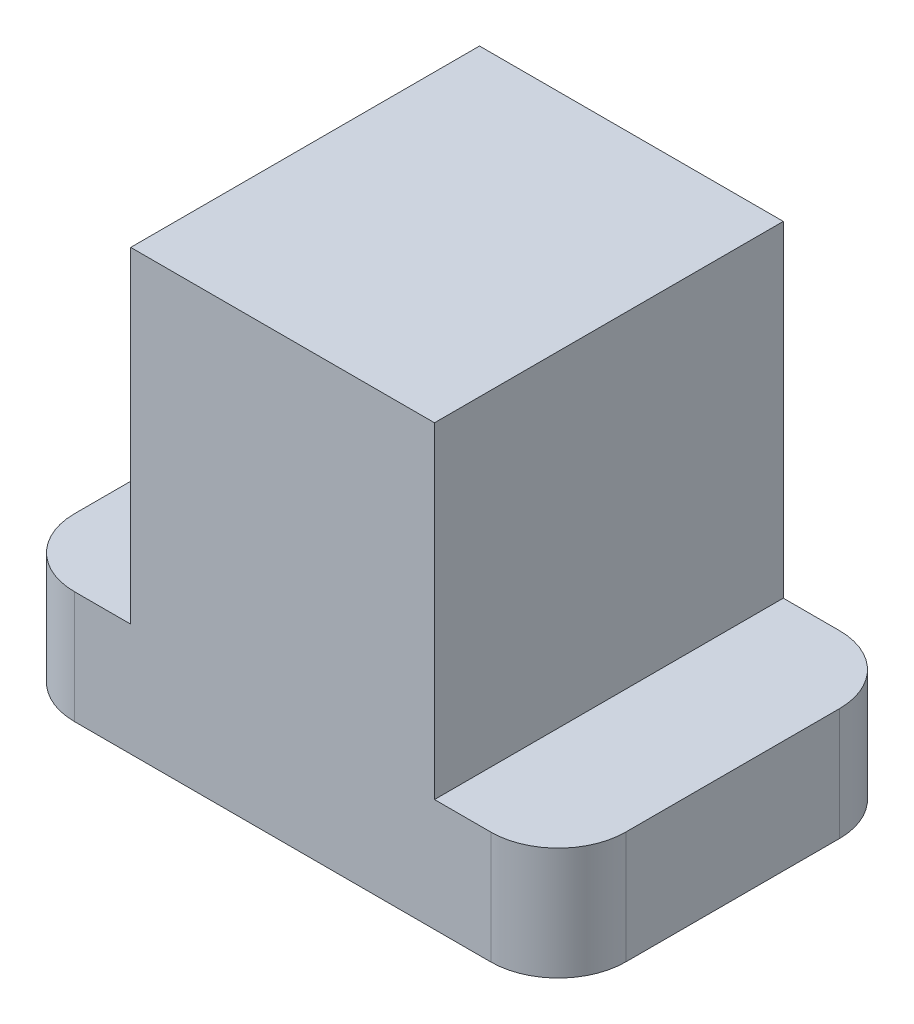
ISO-10303-21;
HEADER;
FILE_DESCRIPTION(('STEP AP214'),'2;1');
FILE_NAME('part.step','',(''),(''),'','','');
FILE_SCHEMA(('AUTOMOTIVE_DESIGN { 1 0 10303 214 1 1 1 1 }'));
ENDSEC;
DATA;
#1=APPLICATION_CONTEXT('core data for automotive mechanical design processes');
#2=APPLICATION_PROTOCOL_DEFINITION('international standard','automotive_design',2000,#1);
#3=PRODUCT_CONTEXT('',#1,'mechanical');
#4=PRODUCT('Part','Part','',(#3));
#5=PRODUCT_RELATED_PRODUCT_CATEGORY('part','',(#4));
#6=PRODUCT_DEFINITION_FORMATION('','',#4);
#7=PRODUCT_DEFINITION_CONTEXT('part definition',#1,'design');
#8=PRODUCT_DEFINITION('design','',#6,#7);
#9=PRODUCT_DEFINITION_SHAPE('','',#8);
#10=(LENGTH_UNIT() NAMED_UNIT(*) SI_UNIT(.MILLI.,.METRE.));
#11=(NAMED_UNIT(*) PLANE_ANGLE_UNIT() SI_UNIT($,.RADIAN.));
#12=(NAMED_UNIT(*) SI_UNIT($,.STERADIAN.) SOLID_ANGLE_UNIT());
#13=UNCERTAINTY_MEASURE_WITH_UNIT(LENGTH_MEASURE(1.E-05),#10,'distance_accuracy_value','');
#14=(GEOMETRIC_REPRESENTATION_CONTEXT(3) GLOBAL_UNCERTAINTY_ASSIGNED_CONTEXT((#13)) GLOBAL_UNIT_ASSIGNED_CONTEXT((#10,
#11,#12)) REPRESENTATION_CONTEXT('',''));
#15=CARTESIAN_POINT('',(0.,0.,0.));
#16=DIRECTION('',(0.,0.,1.));
#17=DIRECTION('',(1.,0.,0.));
#18=AXIS2_PLACEMENT_3D('',#15,#16,#17);
#19=CARTESIAN_POINT('',(37.,20.,-19.));
#20=DIRECTION('',(0.,-1.,0.));
#21=DIRECTION('',(0.,0.,-1.));
#22=AXIS2_PLACEMENT_3D('',#19,#20,#21);
#23=PLANE('',#22);
#24=DIRECTION('',(0.,0.,-1.));
#25=VECTOR('',#24,1.);
#26=CARTESIAN_POINT('',(27.,20.,31.));
#27=LINE('',#26,#25);
#28=CARTESIAN_POINT('',(27.,20.,31.));
#29=VERTEX_POINT('',#28);
#30=CARTESIAN_POINT('',(27.,20.,-31.));
#31=VERTEX_POINT('',#30);
#32=EDGE_CURVE('E59',#29,#31,#27,.T.);
#33=ORIENTED_EDGE('',*,*,#32,.F.);
#34=DIRECTION('',(1.,0.,0.));
#35=VECTOR('',#34,1.);
#36=CARTESIAN_POINT('',(-36.9999999999999,20.,31.));
#37=LINE('',#36,#35);
#38=CARTESIAN_POINT('',(36.9999999999999,20.,31.));
#39=VERTEX_POINT('',#38);
#40=EDGE_CURVE('E186',#29,#39,#37,.T.);
#41=ORIENTED_EDGE('',*,*,#40,.T.);
#42=CARTESIAN_POINT('',(37.,20.,19.));
#43=DIRECTION('',(0.,1.,0.));
#44=DIRECTION('',(0.,0.,1.));
#45=AXIS2_PLACEMENT_3D('',#42,#43,#44);
#46=CIRCLE('',#45,12.);
#47=CARTESIAN_POINT('',(49.,20.,18.9999999999999));
#48=VERTEX_POINT('',#47);
#49=EDGE_CURVE('E190',#39,#48,#46,.T.);
#50=ORIENTED_EDGE('',*,*,#49,.T.);
#51=DIRECTION('',(0.,0.,-1.));
#52=VECTOR('',#51,1.);
#53=CARTESIAN_POINT('',(49.,20.,18.9999999999999));
#54=LINE('',#53,#52);
#55=CARTESIAN_POINT('',(49.,20.,-18.9999999999999));
#56=VERTEX_POINT('',#55);
#57=EDGE_CURVE('E193',#48,#56,#54,.T.);
#58=ORIENTED_EDGE('',*,*,#57,.T.);
#59=CARTESIAN_POINT('',(37.,20.,-19.));
#60=DIRECTION('',(0.,1.,0.));
#61=DIRECTION('',(0.,0.,-1.));
#62=AXIS2_PLACEMENT_3D('',#59,#60,#61);
#63=CIRCLE('',#62,12.);
#64=CARTESIAN_POINT('',(36.9999999999999,20.,-31.));
#65=VERTEX_POINT('',#64);
#66=EDGE_CURVE('E168',#56,#65,#63,.T.);
#67=ORIENTED_EDGE('',*,*,#66,.T.);
#68=DIRECTION('',(-1.,0.,0.));
#69=VECTOR('',#68,1.);
#70=CARTESIAN_POINT('',(-36.9999999999999,20.,-31.));
#71=LINE('',#70,#69);
#72=EDGE_CURVE('E174',#65,#31,#71,.T.);
#73=ORIENTED_EDGE('',*,*,#72,.T.);
#74=EDGE_LOOP('',(#33,#41,#50,#58,#67,#73));
#75=FACE_BOUND('',#74,.T.);
#76=ADVANCED_FACE('F43',(#75),#23,.F.);
#77=DIRECTION('',(0.,0.,1.));
#78=VECTOR('',#77,1.);
#79=CARTESIAN_POINT('',(-27.,20.,31.));
#80=LINE('',#79,#78);
#81=CARTESIAN_POINT('',(-27.,20.,-31.));
#82=VERTEX_POINT('',#81);
#83=CARTESIAN_POINT('',(-27.,20.,31.));
#84=VERTEX_POINT('',#83);
#85=EDGE_CURVE('E67',#82,#84,#80,.T.);
#86=ORIENTED_EDGE('',*,*,#85,.F.);
#87=CARTESIAN_POINT('',(-36.9999999999999,20.,-31.));
#88=VERTEX_POINT('',#87);
#89=EDGE_CURVE('E172',#82,#88,#71,.T.);
#90=ORIENTED_EDGE('',*,*,#89,.T.);
#91=CARTESIAN_POINT('',(-37.,20.,-19.));
#92=DIRECTION('',(0.,1.,0.));
#93=DIRECTION('',(0.,0.,-1.));
#94=AXIS2_PLACEMENT_3D('',#91,#92,#93);
#95=CIRCLE('',#94,12.);
#96=CARTESIAN_POINT('',(-49.,20.,-18.9999999999999));
#97=VERTEX_POINT('',#96);
#98=EDGE_CURVE('E177',#88,#97,#95,.T.);
#99=ORIENTED_EDGE('',*,*,#98,.T.);
#100=DIRECTION('',(0.,0.,1.));
#101=VECTOR('',#100,1.);
#102=CARTESIAN_POINT('',(-49.,20.,18.9999999999999));
#103=LINE('',#102,#101);
#104=CARTESIAN_POINT('',(-49.,20.,18.9999999999999));
#105=VERTEX_POINT('',#104);
#106=EDGE_CURVE('E180',#97,#105,#103,.T.);
#107=ORIENTED_EDGE('',*,*,#106,.T.);
#108=CARTESIAN_POINT('',(-37.,20.,19.));
#109=DIRECTION('',(0.,1.,0.));
#110=DIRECTION('',(0.,0.,-1.));
#111=AXIS2_PLACEMENT_3D('',#108,#109,#110);
#112=CIRCLE('',#111,12.);
#113=CARTESIAN_POINT('',(-36.9999999999999,20.,31.));
#114=VERTEX_POINT('',#113);
#115=EDGE_CURVE('E183',#105,#114,#112,.T.);
#116=ORIENTED_EDGE('',*,*,#115,.T.);
#117=EDGE_CURVE('E187',#114,#84,#37,.T.);
#118=ORIENTED_EDGE('',*,*,#117,.T.);
#119=EDGE_LOOP('',(#86,#90,#99,#107,#116,#118));
#120=FACE_BOUND('',#119,.T.);
#121=ADVANCED_FACE('F261',(#120),#23,.F.);
#122=CARTESIAN_POINT('',(37.,20.,-19.));
#123=DIRECTION('',(0.,-1.,0.));
#124=DIRECTION('',(0.,0.,-1.));
#125=AXIS2_PLACEMENT_3D('',#122,#123,#124);
#126=CYLINDRICAL_SURFACE('',#125,12.);
#127=CARTESIAN_POINT('',(37.,0.,-19.));
#128=DIRECTION('',(0.,1.,0.));
#129=DIRECTION('',(0.,0.,-1.));
#130=AXIS2_PLACEMENT_3D('',#127,#128,#129);
#131=CIRCLE('',#130,12.);
#132=CARTESIAN_POINT('',(49.,0.,-18.9999999999999));
#133=VERTEX_POINT('',#132);
#134=CARTESIAN_POINT('',(36.9999999999999,0.,-31.));
#135=VERTEX_POINT('',#134);
#136=EDGE_CURVE('E157',#133,#135,#131,.T.);
#137=ORIENTED_EDGE('',*,*,#136,.T.);
#138=DIRECTION('',(0.,-1.,0.));
#139=VECTOR('',#138,1.);
#140=CARTESIAN_POINT('',(36.9999999999999,20.,-31.));
#141=LINE('',#140,#139);
#142=EDGE_CURVE('E11',#65,#135,#141,.T.);
#143=ORIENTED_EDGE('',*,*,#142,.F.);
#144=ORIENTED_EDGE('',*,*,#66,.F.);
#145=DIRECTION('',(0.,-1.,0.));
#146=VECTOR('',#145,1.);
#147=CARTESIAN_POINT('',(49.,20.,-18.9999999999999));
#148=LINE('',#147,#146);
#149=EDGE_CURVE('E195',#56,#133,#148,.T.);
#150=ORIENTED_EDGE('',*,*,#149,.T.);
#151=EDGE_LOOP('',(#137,#143,#144,#150));
#152=FACE_BOUND('',#151,.T.);
#153=ADVANCED_FACE('F45',(#152),#126,.T.);
#154=CARTESIAN_POINT('',(-36.9999999999999,20.,-31.));
#155=DIRECTION('',(0.,0.,1.));
#156=DIRECTION('',(1.,0.,0.));
#157=AXIS2_PLACEMENT_3D('',#154,#155,#156);
#158=PLANE('',#157);
#159=DIRECTION('',(-1.,0.,0.));
#160=VECTOR('',#159,1.);
#161=CARTESIAN_POINT('',(-36.9999999999999,0.,-31.));
#162=LINE('',#161,#160);
#163=CARTESIAN_POINT('',(-36.9999999999999,0.,-31.));
#164=VERTEX_POINT('',#163);
#165=EDGE_CURVE('E162',#135,#164,#162,.T.);
#166=ORIENTED_EDGE('',*,*,#165,.T.);
#167=DIRECTION('',(0.,-1.,0.));
#168=VECTOR('',#167,1.);
#169=CARTESIAN_POINT('',(-36.9999999999999,20.,-31.));
#170=LINE('',#169,#168);
#171=EDGE_CURVE('E52',#88,#164,#170,.T.);
#172=ORIENTED_EDGE('',*,*,#171,.F.);
#173=ORIENTED_EDGE('',*,*,#89,.F.);
#174=DIRECTION('',(0.,-1.,0.));
#175=VECTOR('',#174,1.);
#176=CARTESIAN_POINT('',(-27.,78.,-31.));
#177=LINE('',#176,#175);
#178=CARTESIAN_POINT('',(-27.,78.,-31.));
#179=VERTEX_POINT('',#178);
#180=EDGE_CURVE('E139',#179,#82,#177,.T.);
#181=ORIENTED_EDGE('',*,*,#180,.F.);
#182=DIRECTION('',(-1.,0.,0.));
#183=VECTOR('',#182,1.);
#184=CARTESIAN_POINT('',(-27.,78.,-31.));
#185=LINE('',#184,#183);
#186=CARTESIAN_POINT('',(27.,78.,-31.));
#187=VERTEX_POINT('',#186);
#188=EDGE_CURVE('E133',#187,#179,#185,.T.);
#189=ORIENTED_EDGE('',*,*,#188,.F.);
#190=DIRECTION('',(0.,-1.,0.));
#191=VECTOR('',#190,1.);
#192=CARTESIAN_POINT('',(27.,78.,-31.));
#193=LINE('',#192,#191);
#194=EDGE_CURVE('E137',#187,#31,#193,.T.);
#195=ORIENTED_EDGE('',*,*,#194,.T.);
#196=ORIENTED_EDGE('',*,*,#72,.F.);
#197=ORIENTED_EDGE('',*,*,#142,.T.);
#198=EDGE_LOOP('',(#166,#172,#173,#181,#189,#195,#196,#197));
#199=FACE_BOUND('',#198,.T.);
#200=ADVANCED_FACE('F135',(#199),#158,.F.);
#201=CARTESIAN_POINT('',(-37.,20.,-19.));
#202=DIRECTION('',(0.,-1.,0.));
#203=DIRECTION('',(0.,0.,-1.));
#204=AXIS2_PLACEMENT_3D('',#201,#202,#203);
#205=CYLINDRICAL_SURFACE('',#204,12.);
#206=CARTESIAN_POINT('',(-37.,0.,-19.));
#207=DIRECTION('',(0.,1.,0.));
#208=DIRECTION('',(0.,0.,-1.));
#209=AXIS2_PLACEMENT_3D('',#206,#207,#208);
#210=CIRCLE('',#209,12.);
#211=CARTESIAN_POINT('',(-49.,0.,-18.9999999999999));
#212=VERTEX_POINT('',#211);
#213=EDGE_CURVE('E199',#164,#212,#210,.T.);
#214=ORIENTED_EDGE('',*,*,#213,.T.);
#215=DIRECTION('',(0.,-1.,0.));
#216=VECTOR('',#215,1.);
#217=CARTESIAN_POINT('',(-49.,20.,-18.9999999999999));
#218=LINE('',#217,#216);
#219=EDGE_CURVE('E235',#97,#212,#218,.T.);
#220=ORIENTED_EDGE('',*,*,#219,.F.);
#221=ORIENTED_EDGE('',*,*,#98,.F.);
#222=ORIENTED_EDGE('',*,*,#171,.T.);
#223=EDGE_LOOP('',(#214,#220,#221,#222));
#224=FACE_BOUND('',#223,.T.);
#225=ADVANCED_FACE('F244',(#224),#205,.T.);
#226=CARTESIAN_POINT('',(-49.,20.,18.9999999999999));
#227=DIRECTION('',(1.,0.,0.));
#228=DIRECTION('',(0.,0.,-1.));
#229=AXIS2_PLACEMENT_3D('',#226,#227,#228);
#230=PLANE('',#229);
#231=DIRECTION('',(0.,0.,1.));
#232=VECTOR('',#231,1.);
#233=CARTESIAN_POINT('',(-49.,0.,18.9999999999999));
#234=LINE('',#233,#232);
#235=CARTESIAN_POINT('',(-49.,0.,18.9999999999999));
#236=VERTEX_POINT('',#235);
#237=EDGE_CURVE('E202',#212,#236,#234,.T.);
#238=ORIENTED_EDGE('',*,*,#237,.T.);
#239=DIRECTION('',(0.,-1.,0.));
#240=VECTOR('',#239,1.);
#241=CARTESIAN_POINT('',(-49.,20.,18.9999999999999));
#242=LINE('',#241,#240);
#243=EDGE_CURVE('E231',#105,#236,#242,.T.);
#244=ORIENTED_EDGE('',*,*,#243,.F.);
#245=ORIENTED_EDGE('',*,*,#106,.F.);
#246=ORIENTED_EDGE('',*,*,#219,.T.);
#247=EDGE_LOOP('',(#238,#244,#245,#246));
#248=FACE_BOUND('',#247,.T.);
#249=ADVANCED_FACE('F254',(#248),#230,.F.);
#250=CARTESIAN_POINT('',(-37.,20.,19.));
#251=DIRECTION('',(0.,-1.,0.));
#252=DIRECTION('',(0.,0.,-1.));
#253=AXIS2_PLACEMENT_3D('',#250,#251,#252);
#254=CYLINDRICAL_SURFACE('',#253,12.);
#255=CARTESIAN_POINT('',(-37.,0.,19.));
#256=DIRECTION('',(0.,1.,0.));
#257=DIRECTION('',(0.,0.,-1.));
#258=AXIS2_PLACEMENT_3D('',#255,#256,#257);
#259=CIRCLE('',#258,12.);
#260=CARTESIAN_POINT('',(-36.9999999999999,0.,31.));
#261=VERTEX_POINT('',#260);
#262=EDGE_CURVE('E205',#236,#261,#259,.T.);
#263=ORIENTED_EDGE('',*,*,#262,.T.);
#264=DIRECTION('',(0.,-1.,0.));
#265=VECTOR('',#264,1.);
#266=CARTESIAN_POINT('',(-36.9999999999999,20.,31.));
#267=LINE('',#266,#265);
#268=EDGE_CURVE('E227',#114,#261,#267,.T.);
#269=ORIENTED_EDGE('',*,*,#268,.F.);
#270=ORIENTED_EDGE('',*,*,#115,.F.);
#271=ORIENTED_EDGE('',*,*,#243,.T.);
#272=EDGE_LOOP('',(#263,#269,#270,#271));
#273=FACE_BOUND('',#272,.T.);
#274=ADVANCED_FACE('F258',(#273),#254,.T.);
#275=CARTESIAN_POINT('',(-36.9999999999999,20.,31.));
#276=DIRECTION('',(0.,0.,-1.));
#277=DIRECTION('',(-1.,0.,0.));
#278=AXIS2_PLACEMENT_3D('',#275,#276,#277);
#279=PLANE('',#278);
#280=DIRECTION('',(1.,0.,0.));
#281=VECTOR('',#280,1.);
#282=CARTESIAN_POINT('',(-36.9999999999999,0.,31.));
#283=LINE('',#282,#281);
#284=CARTESIAN_POINT('',(36.9999999999999,0.,31.));
#285=VERTEX_POINT('',#284);
#286=EDGE_CURVE('E208',#261,#285,#283,.T.);
#287=ORIENTED_EDGE('',*,*,#286,.T.);
#288=DIRECTION('',(0.,-1.,0.));
#289=VECTOR('',#288,1.);
#290=CARTESIAN_POINT('',(36.9999999999999,20.,31.));
#291=LINE('',#290,#289);
#292=EDGE_CURVE('E223',#39,#285,#291,.T.);
#293=ORIENTED_EDGE('',*,*,#292,.F.);
#294=ORIENTED_EDGE('',*,*,#40,.F.);
#295=DIRECTION('',(0.,-1.,0.));
#296=VECTOR('',#295,1.);
#297=CARTESIAN_POINT('',(27.,78.,31.));
#298=LINE('',#297,#296);
#299=CARTESIAN_POINT('',(27.,78.,31.));
#300=VERTEX_POINT('',#299);
#301=EDGE_CURVE('E430',#300,#29,#298,.T.);
#302=ORIENTED_EDGE('',*,*,#301,.F.);
#303=DIRECTION('',(1.,0.,0.));
#304=VECTOR('',#303,1.);
#305=CARTESIAN_POINT('',(-27.,78.,31.));
#306=LINE('',#305,#304);
#307=CARTESIAN_POINT('',(-27.,78.,31.));
#308=VERTEX_POINT('',#307);
#309=EDGE_CURVE('E149',#308,#300,#306,.T.);
#310=ORIENTED_EDGE('',*,*,#309,.F.);
#311=DIRECTION('',(0.,-1.,0.));
#312=VECTOR('',#311,1.);
#313=CARTESIAN_POINT('',(-27.,78.,31.));
#314=LINE('',#313,#312);
#315=EDGE_CURVE('E164',#308,#84,#314,.T.);
#316=ORIENTED_EDGE('',*,*,#315,.T.);
#317=ORIENTED_EDGE('',*,*,#117,.F.);
#318=ORIENTED_EDGE('',*,*,#268,.T.);
#319=EDGE_LOOP('',(#287,#293,#294,#302,#310,#316,#317,#318));
#320=FACE_BOUND('',#319,.T.);
#321=ADVANCED_FACE('F268',(#320),#279,.F.);
#322=CARTESIAN_POINT('',(37.,20.,19.));
#323=DIRECTION('',(0.,-1.,0.));
#324=DIRECTION('',(0.,0.,-1.));
#325=AXIS2_PLACEMENT_3D('',#322,#323,#324);
#326=CYLINDRICAL_SURFACE('',#325,12.);
#327=CARTESIAN_POINT('',(37.,0.,19.));
#328=DIRECTION('',(0.,1.,0.));
#329=DIRECTION('',(0.,0.,1.));
#330=AXIS2_PLACEMENT_3D('',#327,#328,#329);
#331=CIRCLE('',#330,12.);
#332=CARTESIAN_POINT('',(49.,0.,18.9999999999999));
#333=VERTEX_POINT('',#332);
#334=EDGE_CURVE('E211',#285,#333,#331,.T.);
#335=ORIENTED_EDGE('',*,*,#334,.T.);
#336=DIRECTION('',(0.,-1.,0.));
#337=VECTOR('',#336,1.);
#338=CARTESIAN_POINT('',(49.,20.,18.9999999999999));
#339=LINE('',#338,#337);
#340=EDGE_CURVE('E219',#48,#333,#339,.T.);
#341=ORIENTED_EDGE('',*,*,#340,.F.);
#342=ORIENTED_EDGE('',*,*,#49,.F.);
#343=ORIENTED_EDGE('',*,*,#292,.T.);
#344=EDGE_LOOP('',(#335,#341,#342,#343));
#345=FACE_BOUND('',#344,.T.);
#346=ADVANCED_FACE('F271',(#345),#326,.T.);
#347=CARTESIAN_POINT('',(49.,20.,18.9999999999999));
#348=DIRECTION('',(-1.,0.,0.));
#349=DIRECTION('',(0.,0.,1.));
#350=AXIS2_PLACEMENT_3D('',#347,#348,#349);
#351=PLANE('',#350);
#352=DIRECTION('',(0.,0.,-1.));
#353=VECTOR('',#352,1.);
#354=CARTESIAN_POINT('',(49.,0.,18.9999999999999));
#355=LINE('',#354,#353);
#356=EDGE_CURVE('E173',#333,#133,#355,.T.);
#357=ORIENTED_EDGE('',*,*,#356,.T.);
#358=ORIENTED_EDGE('',*,*,#149,.F.);
#359=ORIENTED_EDGE('',*,*,#57,.F.);
#360=ORIENTED_EDGE('',*,*,#340,.T.);
#361=EDGE_LOOP('',(#357,#358,#359,#360));
#362=FACE_BOUND('',#361,.T.);
#363=ADVANCED_FACE('F276',(#362),#351,.F.);
#364=CARTESIAN_POINT('',(37.,0.,-19.));
#365=DIRECTION('',(0.,-1.,0.));
#366=DIRECTION('',(0.,0.,-1.));
#367=AXIS2_PLACEMENT_3D('',#364,#365,#366);
#368=PLANE('',#367);
#369=ORIENTED_EDGE('',*,*,#136,.F.);
#370=ORIENTED_EDGE('',*,*,#356,.F.);
#371=ORIENTED_EDGE('',*,*,#334,.F.);
#372=ORIENTED_EDGE('',*,*,#286,.F.);
#373=ORIENTED_EDGE('',*,*,#262,.F.);
#374=ORIENTED_EDGE('',*,*,#237,.F.);
#375=ORIENTED_EDGE('',*,*,#213,.F.);
#376=ORIENTED_EDGE('',*,*,#165,.F.);
#377=EDGE_LOOP('',(#369,#370,#371,#372,#373,#374,#375,#376));
#378=FACE_BOUND('',#377,.T.);
#379=ADVANCED_FACE('F249',(#378),#368,.T.);
#380=CARTESIAN_POINT('',(27.,78.,31.));
#381=DIRECTION('',(-1.,0.,0.));
#382=DIRECTION('',(0.,0.,1.));
#383=AXIS2_PLACEMENT_3D('',#380,#381,#382);
#384=PLANE('',#383);
#385=ORIENTED_EDGE('',*,*,#32,.T.);
#386=ORIENTED_EDGE('',*,*,#194,.F.);
#387=DIRECTION('',(0.,0.,-1.));
#388=VECTOR('',#387,1.);
#389=CARTESIAN_POINT('',(27.,78.,31.));
#390=LINE('',#389,#388);
#391=EDGE_CURVE('E144',#300,#187,#390,.T.);
#392=ORIENTED_EDGE('',*,*,#391,.F.);
#393=ORIENTED_EDGE('',*,*,#301,.T.);
#394=EDGE_LOOP('',(#385,#386,#392,#393));
#395=FACE_BOUND('',#394,.T.);
#396=ADVANCED_FACE('F155',(#395),#384,.F.);
#397=CARTESIAN_POINT('',(-27.,78.,31.));
#398=DIRECTION('',(1.,0.,0.));
#399=DIRECTION('',(0.,0.,-1.));
#400=AXIS2_PLACEMENT_3D('',#397,#398,#399);
#401=PLANE('',#400);
#402=ORIENTED_EDGE('',*,*,#85,.T.);
#403=ORIENTED_EDGE('',*,*,#315,.F.);
#404=DIRECTION('',(0.,0.,1.));
#405=VECTOR('',#404,1.);
#406=CARTESIAN_POINT('',(-27.,78.,31.));
#407=LINE('',#406,#405);
#408=EDGE_CURVE('E143',#179,#308,#407,.T.);
#409=ORIENTED_EDGE('',*,*,#408,.F.);
#410=ORIENTED_EDGE('',*,*,#180,.T.);
#411=EDGE_LOOP('',(#402,#403,#409,#410));
#412=FACE_BOUND('',#411,.T.);
#413=ADVANCED_FACE('F339',(#412),#401,.F.);
#414=CARTESIAN_POINT('',(0.,78.,0.));
#415=DIRECTION('',(0.,-1.,0.));
#416=DIRECTION('',(0.,0.,-1.));
#417=AXIS2_PLACEMENT_3D('',#414,#415,#416);
#418=PLANE('',#417);
#419=ORIENTED_EDGE('',*,*,#391,.T.);
#420=ORIENTED_EDGE('',*,*,#188,.T.);
#421=ORIENTED_EDGE('',*,*,#408,.T.);
#422=ORIENTED_EDGE('',*,*,#309,.T.);
#423=EDGE_LOOP('',(#419,#420,#421,#422));
#424=FACE_BOUND('',#423,.T.);
#425=ADVANCED_FACE('F147',(#424),#418,.F.);
#426=CLOSED_SHELL('',(#76,#121,#153,#200,#225,#249,#274,#321,#346,#363,#379,#396,#413,#425));
#427=MANIFOLD_SOLID_BREP('B2',#426);
#428=ADVANCED_BREP_SHAPE_REPRESENTATION('',(#18,#427),#14);
#429=SHAPE_DEFINITION_REPRESENTATION(#9,#428);
ENDSEC;
END-ISO-10303-21;
